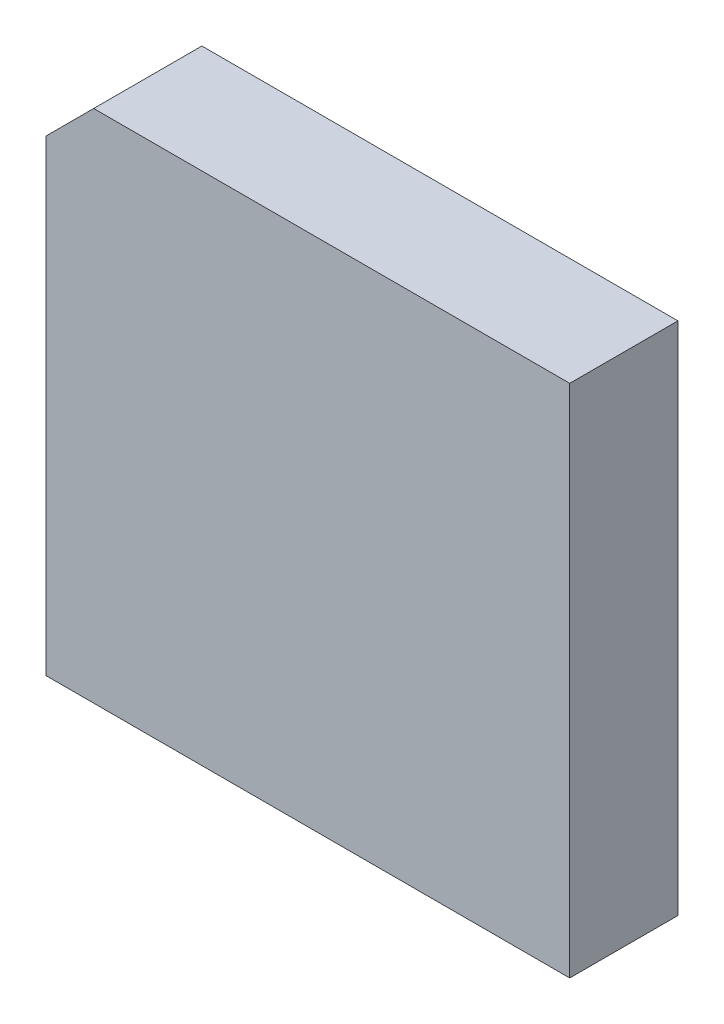
ISO-10303-21;
HEADER;
FILE_DESCRIPTION(('STEP AP214'),'2;1');
FILE_NAME('part.step','',(''),(''),'','','');
FILE_SCHEMA(('AUTOMOTIVE_DESIGN { 1 0 10303 214 1 1 1 1 }'));
ENDSEC;
DATA;
#1=APPLICATION_CONTEXT('core data for automotive mechanical design processes');
#2=APPLICATION_PROTOCOL_DEFINITION('international standard','automotive_design',2000,#1);
#3=PRODUCT_CONTEXT('',#1,'mechanical');
#4=PRODUCT('Part','Part','',(#3));
#5=PRODUCT_RELATED_PRODUCT_CATEGORY('part','',(#4));
#6=PRODUCT_DEFINITION_FORMATION('','',#4);
#7=PRODUCT_DEFINITION_CONTEXT('part definition',#1,'design');
#8=PRODUCT_DEFINITION('design','',#6,#7);
#9=PRODUCT_DEFINITION_SHAPE('','',#8);
#10=(LENGTH_UNIT() NAMED_UNIT(*) SI_UNIT(.MILLI.,.METRE.));
#11=(NAMED_UNIT(*) PLANE_ANGLE_UNIT() SI_UNIT($,.RADIAN.));
#12=(NAMED_UNIT(*) SI_UNIT($,.STERADIAN.) SOLID_ANGLE_UNIT());
#13=UNCERTAINTY_MEASURE_WITH_UNIT(LENGTH_MEASURE(1.E-05),#10,'distance_accuracy_value','');
#14=(GEOMETRIC_REPRESENTATION_CONTEXT(3) GLOBAL_UNCERTAINTY_ASSIGNED_CONTEXT((#13)) GLOBAL_UNIT_ASSIGNED_CONTEXT((#10,
#11,#12)) REPRESENTATION_CONTEXT('',''));
#15=CARTESIAN_POINT('',(0.,0.,0.));
#16=DIRECTION('',(0.,0.,1.));
#17=DIRECTION('',(1.,0.,0.));
#18=AXIS2_PLACEMENT_3D('',#15,#16,#17);
#19=CARTESIAN_POINT('',(-4.95000026,5.94999826,0.));
#20=DIRECTION('',(0.707107597574076,-0.707105964798076,0.));
#21=DIRECTION('',(0.707105964798076,0.707107597574076,0.));
#22=AXIS2_PLACEMENT_3D('',#19,#20,#21);
#23=PLANE('',#22);
#24=DIRECTION('',(0.,0.,-1.));
#25=VECTOR('',#24,1.);
#26=CARTESIAN_POINT('',(-6.04999806,4.84999792,0.));
#27=LINE('',#26,#25);
#28=CARTESIAN_POINT('',(-6.0499980599997,4.8499979199997,0.));
#29=VERTEX_POINT('',#28);
#30=CARTESIAN_POINT('',(-6.0499980599997,4.8499979199997,2.50000008));
#31=VERTEX_POINT('',#30);
#32=EDGE_CURVE('E72',#29,#31,#27,.F.);
#33=ORIENTED_EDGE('',*,*,#32,.T.);
#34=DIRECTION('',(0.707105964798466,0.707107597573687,0.));
#35=VECTOR('',#34,1.);
#36=CARTESIAN_POINT('',(-6.04999806,4.84999792,2.50000008));
#37=LINE('',#36,#35);
#38=CARTESIAN_POINT('',(-4.95000026,5.94999826,2.50000008));
#39=VERTEX_POINT('',#38);
#40=EDGE_CURVE('E67',#31,#39,#37,.T.);
#41=ORIENTED_EDGE('',*,*,#40,.T.);
#42=DIRECTION('',(0.,0.,-1.));
#43=VECTOR('',#42,1.);
#44=CARTESIAN_POINT('',(-4.95000026,5.94999826,0.));
#45=LINE('',#44,#43);
#46=CARTESIAN_POINT('',(-4.95000026,5.94999826,0.));
#47=VERTEX_POINT('',#46);
#48=EDGE_CURVE('E69',#39,#47,#45,.T.);
#49=ORIENTED_EDGE('',*,*,#48,.T.);
#50=DIRECTION('',(0.707105964798076,0.707107597574076,0.));
#51=VECTOR('',#50,1.);
#52=CARTESIAN_POINT('',(-4.95000026,5.94999826,0.));
#53=LINE('',#52,#51);
#54=EDGE_CURVE('E19',#29,#47,#53,.T.);
#55=ORIENTED_EDGE('',*,*,#54,.F.);
#56=EDGE_LOOP('',(#33,#41,#49,#55));
#57=FACE_BOUND('',#56,.T.);
#58=ADVANCED_FACE('F16',(#57),#23,.F.);
#59=CARTESIAN_POINT('',(-6.04999806,4.84999792,2.50000008));
#60=DIRECTION('',(0.,0.,-1.));
#61=DIRECTION('',(-1.,0.,0.));
#62=AXIS2_PLACEMENT_3D('',#59,#60,#61);
#63=PLANE('',#62);
#64=DIRECTION('',(1.,0.,0.));
#65=VECTOR('',#64,1.);
#66=CARTESIAN_POINT('',(-6.04999806,-5.9500008,2.50000008));
#67=LINE('',#66,#65);
#68=CARTESIAN_POINT('',(-6.04999806,-5.9500008,2.50000008));
#69=VERTEX_POINT('',#68);
#70=CARTESIAN_POINT('',(6.0500006,-5.9500008,2.50000008));
#71=VERTEX_POINT('',#70);
#72=EDGE_CURVE('E87',#69,#71,#67,.T.);
#73=ORIENTED_EDGE('',*,*,#72,.T.);
#74=DIRECTION('',(0.,1.,0.));
#75=VECTOR('',#74,1.);
#76=CARTESIAN_POINT('',(6.0500006,-5.9500008,2.50000008));
#77=LINE('',#76,#75);
#78=CARTESIAN_POINT('',(6.0500006,5.94999826,2.50000008));
#79=VERTEX_POINT('',#78);
#80=EDGE_CURVE('E61',#71,#79,#77,.T.);
#81=ORIENTED_EDGE('',*,*,#80,.T.);
#82=DIRECTION('',(1.,0.,0.));
#83=VECTOR('',#82,1.);
#84=CARTESIAN_POINT('',(6.0500006,5.94999826,2.50000008));
#85=LINE('',#84,#83);
#86=EDGE_CURVE('E74',#79,#39,#85,.F.);
#87=ORIENTED_EDGE('',*,*,#86,.T.);
#88=ORIENTED_EDGE('',*,*,#40,.F.);
#89=DIRECTION('',(0.,1.,0.));
#90=VECTOR('',#89,1.);
#91=CARTESIAN_POINT('',(-6.04999806,4.84999792,2.50000008));
#92=LINE('',#91,#90);
#93=EDGE_CURVE('E92',#31,#69,#92,.F.);
#94=ORIENTED_EDGE('',*,*,#93,.T.);
#95=EDGE_LOOP('',(#73,#81,#87,#88,#94));
#96=FACE_BOUND('',#95,.T.);
#97=ADVANCED_FACE('F75',(#96),#63,.F.);
#98=CARTESIAN_POINT('',(6.0500006,5.94999826,0.));
#99=DIRECTION('',(0.,-1.,0.));
#100=DIRECTION('',(0.,0.,-1.));
#101=AXIS2_PLACEMENT_3D('',#98,#99,#100);
#102=PLANE('',#101);
#103=ORIENTED_EDGE('',*,*,#48,.F.);
#104=ORIENTED_EDGE('',*,*,#86,.F.);
#105=DIRECTION('',(0.,0.,1.));
#106=VECTOR('',#105,1.);
#107=CARTESIAN_POINT('',(6.0500006,5.94999826,0.));
#108=LINE('',#107,#106);
#109=CARTESIAN_POINT('',(6.0500006,5.94999826,0.));
#110=VERTEX_POINT('',#109);
#111=EDGE_CURVE('E83',#79,#110,#108,.F.);
#112=ORIENTED_EDGE('',*,*,#111,.T.);
#113=DIRECTION('',(-1.,0.,0.));
#114=VECTOR('',#113,1.);
#115=CARTESIAN_POINT('',(-6.04999806,5.94999826,0.));
#116=LINE('',#115,#114);
#117=EDGE_CURVE('E81',#47,#110,#116,.F.);
#118=ORIENTED_EDGE('',*,*,#117,.F.);
#119=EDGE_LOOP('',(#103,#104,#112,#118));
#120=FACE_BOUND('',#119,.T.);
#121=ADVANCED_FACE('F79',(#120),#102,.F.);
#122=CARTESIAN_POINT('',(6.0500006,-5.9500008,0.));
#123=DIRECTION('',(-1.,0.,0.));
#124=DIRECTION('',(0.,0.,1.));
#125=AXIS2_PLACEMENT_3D('',#122,#123,#124);
#126=PLANE('',#125);
#127=ORIENTED_EDGE('',*,*,#111,.F.);
#128=ORIENTED_EDGE('',*,*,#80,.F.);
#129=DIRECTION('',(0.,0.,1.));
#130=VECTOR('',#129,1.);
#131=CARTESIAN_POINT('',(6.0500006,-5.9500008,0.));
#132=LINE('',#131,#130);
#133=CARTESIAN_POINT('',(6.0500006,-5.9500008,0.));
#134=VERTEX_POINT('',#133);
#135=EDGE_CURVE('E89',#71,#134,#132,.F.);
#136=ORIENTED_EDGE('',*,*,#135,.T.);
#137=DIRECTION('',(0.,1.,0.));
#138=VECTOR('',#137,1.);
#139=CARTESIAN_POINT('',(6.0500006,4.84999792,0.));
#140=LINE('',#139,#138);
#141=EDGE_CURVE('E96',#110,#134,#140,.F.);
#142=ORIENTED_EDGE('',*,*,#141,.F.);
#143=EDGE_LOOP('',(#127,#128,#136,#142));
#144=FACE_BOUND('',#143,.T.);
#145=ADVANCED_FACE('F106',(#144),#126,.F.);
#146=CARTESIAN_POINT('',(-6.04999806,-5.9500008,0.));
#147=DIRECTION('',(0.,1.,0.));
#148=DIRECTION('',(0.,0.,1.));
#149=AXIS2_PLACEMENT_3D('',#146,#147,#148);
#150=PLANE('',#149);
#151=ORIENTED_EDGE('',*,*,#135,.F.);
#152=ORIENTED_EDGE('',*,*,#72,.F.);
#153=DIRECTION('',(0.,0.,-1.));
#154=VECTOR('',#153,1.);
#155=CARTESIAN_POINT('',(-6.04999806,-5.9500008,0.));
#156=LINE('',#155,#154);
#157=CARTESIAN_POINT('',(-6.04999806,-5.9500008,0.));
#158=VERTEX_POINT('',#157);
#159=EDGE_CURVE('E34',#69,#158,#156,.T.);
#160=ORIENTED_EDGE('',*,*,#159,.T.);
#161=DIRECTION('',(-1.,0.,0.));
#162=VECTOR('',#161,1.);
#163=CARTESIAN_POINT('',(-6.04999806,-5.9500008,0.));
#164=LINE('',#163,#162);
#165=EDGE_CURVE('E25',#134,#158,#164,.T.);
#166=ORIENTED_EDGE('',*,*,#165,.F.);
#167=EDGE_LOOP('',(#151,#152,#160,#166));
#168=FACE_BOUND('',#167,.T.);
#169=ADVANCED_FACE('F104',(#168),#150,.F.);
#170=CARTESIAN_POINT('',(-6.04999806,4.84999792,0.));
#171=DIRECTION('',(1.,0.,0.));
#172=DIRECTION('',(0.,0.,-1.));
#173=AXIS2_PLACEMENT_3D('',#170,#171,#172);
#174=PLANE('',#173);
#175=ORIENTED_EDGE('',*,*,#159,.F.);
#176=ORIENTED_EDGE('',*,*,#93,.F.);
#177=ORIENTED_EDGE('',*,*,#32,.F.);
#178=DIRECTION('',(0.,1.,0.));
#179=VECTOR('',#178,1.);
#180=CARTESIAN_POINT('',(-6.04999806,4.84999792,0.));
#181=LINE('',#180,#179);
#182=EDGE_CURVE('E10',#158,#29,#181,.T.);
#183=ORIENTED_EDGE('',*,*,#182,.F.);
#184=EDGE_LOOP('',(#175,#176,#177,#183));
#185=FACE_BOUND('',#184,.T.);
#186=ADVANCED_FACE('F108',(#185),#174,.F.);
#187=CARTESIAN_POINT('',(-6.04999806,4.84999792,0.));
#188=DIRECTION('',(0.,0.,-1.));
#189=DIRECTION('',(-1.,0.,0.));
#190=AXIS2_PLACEMENT_3D('',#187,#188,#189);
#191=PLANE('',#190);
#192=ORIENTED_EDGE('',*,*,#165,.T.);
#193=ORIENTED_EDGE('',*,*,#182,.T.);
#194=ORIENTED_EDGE('',*,*,#54,.T.);
#195=ORIENTED_EDGE('',*,*,#117,.T.);
#196=ORIENTED_EDGE('',*,*,#141,.T.);
#197=EDGE_LOOP('',(#192,#193,#194,#195,#196));
#198=FACE_BOUND('',#197,.T.);
#199=ADVANCED_FACE('F101',(#198),#191,.T.);
#200=CLOSED_SHELL('',(#58,#97,#121,#145,#169,#186,#199));
#201=MANIFOLD_SOLID_BREP('B1',#200);
#202=ADVANCED_BREP_SHAPE_REPRESENTATION('',(#18,#201),#14);
#203=SHAPE_DEFINITION_REPRESENTATION(#9,#202);
ENDSEC;
END-ISO-10303-21;
